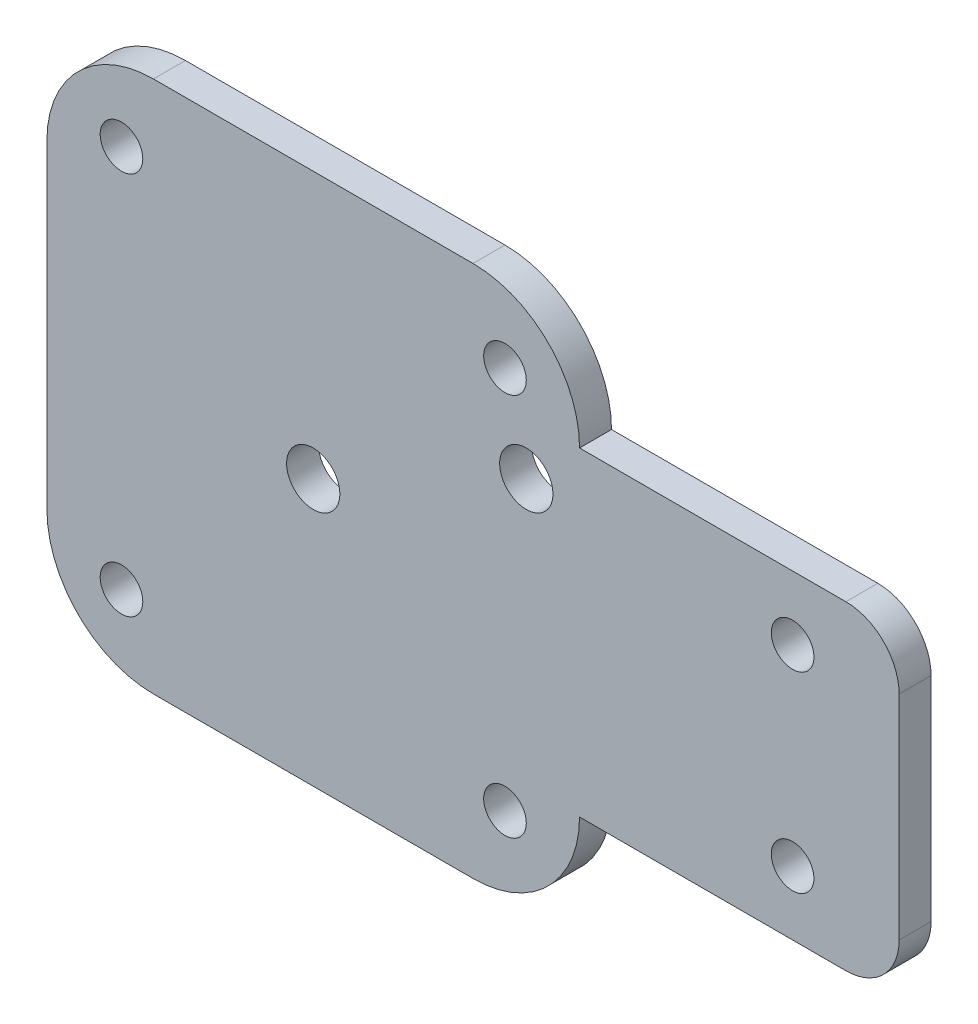
ISO-10303-21;
HEADER;
FILE_DESCRIPTION(('STEP AP214'),'2;1');
FILE_NAME('part.step','',(''),(''),'','','');
FILE_SCHEMA(('AUTOMOTIVE_DESIGN { 1 0 10303 214 1 1 1 1 }'));
ENDSEC;
DATA;
#1=APPLICATION_CONTEXT('core data for automotive mechanical design processes');
#2=APPLICATION_PROTOCOL_DEFINITION('international standard','automotive_design',2000,#1);
#3=PRODUCT_CONTEXT('',#1,'mechanical');
#4=PRODUCT('Part','Part','',(#3));
#5=PRODUCT_RELATED_PRODUCT_CATEGORY('part','',(#4));
#6=PRODUCT_DEFINITION_FORMATION('','',#4);
#7=PRODUCT_DEFINITION_CONTEXT('part definition',#1,'design');
#8=PRODUCT_DEFINITION('design','',#6,#7);
#9=PRODUCT_DEFINITION_SHAPE('','',#8);
#10=(LENGTH_UNIT() NAMED_UNIT(*) SI_UNIT(.MILLI.,.METRE.));
#11=(NAMED_UNIT(*) PLANE_ANGLE_UNIT() SI_UNIT($,.RADIAN.));
#12=(NAMED_UNIT(*) SI_UNIT($,.STERADIAN.) SOLID_ANGLE_UNIT());
#13=UNCERTAINTY_MEASURE_WITH_UNIT(LENGTH_MEASURE(1.E-05),#10,'distance_accuracy_value','');
#14=(GEOMETRIC_REPRESENTATION_CONTEXT(3) GLOBAL_UNCERTAINTY_ASSIGNED_CONTEXT((#13)) GLOBAL_UNIT_ASSIGNED_CONTEXT((#10,
#11,#12)) REPRESENTATION_CONTEXT('',''));
#15=CARTESIAN_POINT('',(0.,0.,0.));
#16=DIRECTION('',(0.,0.,1.));
#17=DIRECTION('',(1.,0.,0.));
#18=AXIS2_PLACEMENT_3D('',#15,#16,#17);
#19=CARTESIAN_POINT('',(10.,40.,3.));
#20=DIRECTION('',(0.,0.,-1.));
#21=DIRECTION('',(-1.,0.,0.));
#22=AXIS2_PLACEMENT_3D('',#19,#20,#21);
#23=CYLINDRICAL_SURFACE('',#22,10.);
#24=CARTESIAN_POINT('',(10.,40.,0.));
#25=DIRECTION('',(0.,0.,1.));
#26=DIRECTION('',(1.,0.,0.));
#27=AXIS2_PLACEMENT_3D('',#24,#25,#26);
#28=CIRCLE('',#27,10.);
#29=CARTESIAN_POINT('',(0.,39.9999999999999,0.));
#30=VERTEX_POINT('',#29);
#31=CARTESIAN_POINT('',(10.0000000000001,50.,0.));
#32=VERTEX_POINT('',#31);
#33=EDGE_CURVE('E180',#30,#32,#28,.F.);
#34=ORIENTED_EDGE('',*,*,#33,.F.);
#35=DIRECTION('',(0.,0.,-1.));
#36=VECTOR('',#35,1.);
#37=CARTESIAN_POINT('',(0.,39.9999999999999,3.));
#38=LINE('',#37,#36);
#39=CARTESIAN_POINT('',(0.,39.9999999999999,3.));
#40=VERTEX_POINT('',#39);
#41=EDGE_CURVE('E11',#40,#30,#38,.T.);
#42=ORIENTED_EDGE('',*,*,#41,.F.);
#43=CARTESIAN_POINT('',(10.,40.,3.));
#44=DIRECTION('',(0.,0.,1.));
#45=DIRECTION('',(1.,0.,0.));
#46=AXIS2_PLACEMENT_3D('',#43,#44,#45);
#47=CIRCLE('',#46,10.);
#48=CARTESIAN_POINT('',(10.0000000000001,50.,3.));
#49=VERTEX_POINT('',#48);
#50=EDGE_CURVE('E268',#40,#49,#47,.F.);
#51=ORIENTED_EDGE('',*,*,#50,.T.);
#52=DIRECTION('',(0.,0.,-1.));
#53=VECTOR('',#52,1.);
#54=CARTESIAN_POINT('',(10.0000000000001,50.,3.));
#55=LINE('',#54,#53);
#56=EDGE_CURVE('E54',#49,#32,#55,.T.);
#57=ORIENTED_EDGE('',*,*,#56,.T.);
#58=EDGE_LOOP('',(#34,#42,#51,#57));
#59=FACE_BOUND('',#58,.T.);
#60=ADVANCED_FACE('F37',(#59),#23,.T.);
#61=CARTESIAN_POINT('',(0.,0.,3.));
#62=DIRECTION('',(-1.,0.,0.));
#63=DIRECTION('',(0.,0.,1.));
#64=AXIS2_PLACEMENT_3D('',#61,#62,#63);
#65=PLANE('',#64);
#66=DIRECTION('',(0.,1.,0.));
#67=VECTOR('',#66,1.);
#68=CARTESIAN_POINT('',(0.,0.,0.));
#69=LINE('',#68,#67);
#70=CARTESIAN_POINT('',(0.,10.0000000000001,0.));
#71=VERTEX_POINT('',#70);
#72=EDGE_CURVE('E182',#71,#30,#69,.T.);
#73=ORIENTED_EDGE('',*,*,#72,.F.);
#74=DIRECTION('',(0.,0.,-1.));
#75=VECTOR('',#74,1.);
#76=CARTESIAN_POINT('',(0.,10.0000000000001,3.));
#77=LINE('',#76,#75);
#78=CARTESIAN_POINT('',(0.,10.0000000000001,3.));
#79=VERTEX_POINT('',#78);
#80=EDGE_CURVE('E46',#79,#71,#77,.T.);
#81=ORIENTED_EDGE('',*,*,#80,.F.);
#82=DIRECTION('',(0.,1.,0.));
#83=VECTOR('',#82,1.);
#84=CARTESIAN_POINT('',(0.,0.,3.));
#85=LINE('',#84,#83);
#86=EDGE_CURVE('E266',#79,#40,#85,.T.);
#87=ORIENTED_EDGE('',*,*,#86,.T.);
#88=ORIENTED_EDGE('',*,*,#41,.T.);
#89=EDGE_LOOP('',(#73,#81,#87,#88));
#90=FACE_BOUND('',#89,.T.);
#91=ADVANCED_FACE('F252',(#90),#65,.T.);
#92=CARTESIAN_POINT('',(10.,10.,3.));
#93=DIRECTION('',(0.,0.,-1.));
#94=DIRECTION('',(-1.,0.,0.));
#95=AXIS2_PLACEMENT_3D('',#92,#93,#94);
#96=CYLINDRICAL_SURFACE('',#95,10.);
#97=CARTESIAN_POINT('',(10.,10.,0.));
#98=DIRECTION('',(0.,0.,1.));
#99=DIRECTION('',(1.,0.,0.));
#100=AXIS2_PLACEMENT_3D('',#97,#98,#99);
#101=CIRCLE('',#100,10.);
#102=CARTESIAN_POINT('',(10.0000000000001,0.,0.));
#103=VERTEX_POINT('',#102);
#104=EDGE_CURVE('E185',#103,#71,#101,.F.);
#105=ORIENTED_EDGE('',*,*,#104,.F.);
#106=DIRECTION('',(0.,0.,-1.));
#107=VECTOR('',#106,1.);
#108=CARTESIAN_POINT('',(10.0000000000001,0.,3.));
#109=LINE('',#108,#107);
#110=CARTESIAN_POINT('',(10.0000000000001,0.,3.));
#111=VERTEX_POINT('',#110);
#112=EDGE_CURVE('E241',#111,#103,#109,.T.);
#113=ORIENTED_EDGE('',*,*,#112,.F.);
#114=CARTESIAN_POINT('',(10.,10.,3.));
#115=DIRECTION('',(0.,0.,1.));
#116=DIRECTION('',(1.,0.,0.));
#117=AXIS2_PLACEMENT_3D('',#114,#115,#116);
#118=CIRCLE('',#117,10.);
#119=EDGE_CURVE('E248',#111,#79,#118,.F.);
#120=ORIENTED_EDGE('',*,*,#119,.T.);
#121=ORIENTED_EDGE('',*,*,#80,.T.);
#122=EDGE_LOOP('',(#105,#113,#120,#121));
#123=FACE_BOUND('',#122,.T.);
#124=ADVANCED_FACE('F246',(#123),#96,.T.);
#125=CARTESIAN_POINT('',(0.,0.,3.));
#126=DIRECTION('',(0.,1.,0.));
#127=DIRECTION('',(0.,0.,1.));
#128=AXIS2_PLACEMENT_3D('',#125,#126,#127);
#129=PLANE('',#128);
#130=DIRECTION('',(1.,0.,0.));
#131=VECTOR('',#130,1.);
#132=CARTESIAN_POINT('',(0.,0.,0.));
#133=LINE('',#132,#131);
#134=CARTESIAN_POINT('',(39.9999999999999,0.,0.));
#135=VERTEX_POINT('',#134);
#136=EDGE_CURVE('E188',#103,#135,#133,.T.);
#137=ORIENTED_EDGE('',*,*,#136,.T.);
#138=DIRECTION('',(0.,0.,-1.));
#139=VECTOR('',#138,1.);
#140=CARTESIAN_POINT('',(39.9999999999999,0.,3.));
#141=LINE('',#140,#139);
#142=CARTESIAN_POINT('',(39.9999999999999,0.,3.));
#143=VERTEX_POINT('',#142);
#144=EDGE_CURVE('E238',#143,#135,#141,.T.);
#145=ORIENTED_EDGE('',*,*,#144,.F.);
#146=DIRECTION('',(1.,0.,0.));
#147=VECTOR('',#146,1.);
#148=CARTESIAN_POINT('',(0.,0.,3.));
#149=LINE('',#148,#147);
#150=EDGE_CURVE('E262',#111,#143,#149,.T.);
#151=ORIENTED_EDGE('',*,*,#150,.F.);
#152=ORIENTED_EDGE('',*,*,#112,.T.);
#153=EDGE_LOOP('',(#137,#145,#151,#152));
#154=FACE_BOUND('',#153,.T.);
#155=ADVANCED_FACE('F259',(#154),#129,.F.);
#156=CARTESIAN_POINT('',(40.,10.,3.));
#157=DIRECTION('',(0.,0.,-1.));
#158=DIRECTION('',(-1.,0.,0.));
#159=AXIS2_PLACEMENT_3D('',#156,#157,#158);
#160=CYLINDRICAL_SURFACE('',#159,10.);
#161=CARTESIAN_POINT('',(40.,10.,0.));
#162=DIRECTION('',(0.,0.,1.));
#163=DIRECTION('',(1.,0.,0.));
#164=AXIS2_PLACEMENT_3D('',#161,#162,#163);
#165=CIRCLE('',#164,10.);
#166=CARTESIAN_POINT('',(50.,10.0000000000001,0.));
#167=VERTEX_POINT('',#166);
#168=EDGE_CURVE('E191',#135,#167,#165,.T.);
#169=ORIENTED_EDGE('',*,*,#168,.T.);
#170=DIRECTION('',(0.,0.,-1.));
#171=VECTOR('',#170,1.);
#172=CARTESIAN_POINT('',(50.,10.0000000000001,3.));
#173=LINE('',#172,#171);
#174=CARTESIAN_POINT('',(50.,10.0000000000001,3.));
#175=VERTEX_POINT('',#174);
#176=EDGE_CURVE('E235',#175,#167,#173,.T.);
#177=ORIENTED_EDGE('',*,*,#176,.F.);
#178=CARTESIAN_POINT('',(40.,10.,3.));
#179=DIRECTION('',(0.,0.,1.));
#180=DIRECTION('',(1.,0.,0.));
#181=AXIS2_PLACEMENT_3D('',#178,#179,#180);
#182=CIRCLE('',#181,10.);
#183=EDGE_CURVE('E264',#143,#175,#182,.T.);
#184=ORIENTED_EDGE('',*,*,#183,.F.);
#185=ORIENTED_EDGE('',*,*,#144,.T.);
#186=EDGE_LOOP('',(#169,#177,#184,#185));
#187=FACE_BOUND('',#186,.T.);
#188=ADVANCED_FACE('F474',(#187),#160,.T.);
#189=CARTESIAN_POINT('',(0.,10.0000000000002,3.));
#190=DIRECTION('',(0.,1.,0.));
#191=DIRECTION('',(-1.,0.,0.));
#192=AXIS2_PLACEMENT_3D('',#189,#190,#191);
#193=PLANE('',#192);
#194=DIRECTION('',(1.,0.,0.));
#195=VECTOR('',#194,1.);
#196=CARTESIAN_POINT('',(0.,10.0000000000002,0.));
#197=LINE('',#196,#195);
#198=CARTESIAN_POINT('',(75.,10.,0.));
#199=VERTEX_POINT('',#198);
#200=EDGE_CURVE('E194',#167,#199,#197,.T.);
#201=ORIENTED_EDGE('',*,*,#200,.T.);
#202=DIRECTION('',(0.,0.,-1.));
#203=VECTOR('',#202,1.);
#204=CARTESIAN_POINT('',(75.,10.,3.));
#205=LINE('',#204,#203);
#206=CARTESIAN_POINT('',(75.,10.,3.));
#207=VERTEX_POINT('',#206);
#208=EDGE_CURVE('E232',#207,#199,#205,.T.);
#209=ORIENTED_EDGE('',*,*,#208,.F.);
#210=DIRECTION('',(1.,0.,0.));
#211=VECTOR('',#210,1.);
#212=CARTESIAN_POINT('',(0.,10.0000000000002,3.));
#213=LINE('',#212,#211);
#214=EDGE_CURVE('E273',#175,#207,#213,.T.);
#215=ORIENTED_EDGE('',*,*,#214,.F.);
#216=ORIENTED_EDGE('',*,*,#176,.T.);
#217=EDGE_LOOP('',(#201,#209,#215,#216));
#218=FACE_BOUND('',#217,.T.);
#219=ADVANCED_FACE('F465',(#218),#193,.F.);
#220=CARTESIAN_POINT('',(75.,15.,3.));
#221=DIRECTION('',(0.,0.,-1.));
#222=DIRECTION('',(-1.,0.,0.));
#223=AXIS2_PLACEMENT_3D('',#220,#221,#222);
#224=CYLINDRICAL_SURFACE('',#223,5.);
#225=CARTESIAN_POINT('',(75.,15.,0.));
#226=DIRECTION('',(0.,0.,1.));
#227=DIRECTION('',(1.,0.,0.));
#228=AXIS2_PLACEMENT_3D('',#225,#226,#227);
#229=CIRCLE('',#228,5.);
#230=CARTESIAN_POINT('',(80.,15.,0.));
#231=VERTEX_POINT('',#230);
#232=EDGE_CURVE('E197',#199,#231,#229,.T.);
#233=ORIENTED_EDGE('',*,*,#232,.T.);
#234=DIRECTION('',(0.,0.,-1.));
#235=VECTOR('',#234,1.);
#236=CARTESIAN_POINT('',(80.,15.,3.));
#237=LINE('',#236,#235);
#238=CARTESIAN_POINT('',(80.,15.,3.));
#239=VERTEX_POINT('',#238);
#240=EDGE_CURVE('E230',#239,#231,#237,.T.);
#241=ORIENTED_EDGE('',*,*,#240,.F.);
#242=CARTESIAN_POINT('',(75.,15.,3.));
#243=DIRECTION('',(0.,0.,1.));
#244=DIRECTION('',(1.,0.,0.));
#245=AXIS2_PLACEMENT_3D('',#242,#243,#244);
#246=CIRCLE('',#245,5.);
#247=EDGE_CURVE('E276',#207,#239,#246,.T.);
#248=ORIENTED_EDGE('',*,*,#247,.F.);
#249=ORIENTED_EDGE('',*,*,#208,.T.);
#250=EDGE_LOOP('',(#233,#241,#248,#249));
#251=FACE_BOUND('',#250,.T.);
#252=ADVANCED_FACE('F456',(#251),#224,.T.);
#253=CARTESIAN_POINT('',(80.,0.,3.));
#254=DIRECTION('',(1.,0.,0.));
#255=DIRECTION('',(0.,0.,-1.));
#256=AXIS2_PLACEMENT_3D('',#253,#254,#255);
#257=PLANE('',#256);
#258=DIRECTION('',(0.,-1.,0.));
#259=VECTOR('',#258,1.);
#260=CARTESIAN_POINT('',(80.,0.,0.));
#261=LINE('',#260,#259);
#262=CARTESIAN_POINT('',(80.,35.,0.));
#263=VERTEX_POINT('',#262);
#264=EDGE_CURVE('E200',#263,#231,#261,.T.);
#265=ORIENTED_EDGE('',*,*,#264,.F.);
#266=DIRECTION('',(0.,0.,-1.));
#267=VECTOR('',#266,1.);
#268=CARTESIAN_POINT('',(80.,35.,3.));
#269=LINE('',#268,#267);
#270=CARTESIAN_POINT('',(80.,35.,3.));
#271=VERTEX_POINT('',#270);
#272=EDGE_CURVE('E228',#271,#263,#269,.T.);
#273=ORIENTED_EDGE('',*,*,#272,.F.);
#274=DIRECTION('',(0.,-1.,0.));
#275=VECTOR('',#274,1.);
#276=CARTESIAN_POINT('',(80.,0.,3.));
#277=LINE('',#276,#275);
#278=EDGE_CURVE('E278',#271,#239,#277,.T.);
#279=ORIENTED_EDGE('',*,*,#278,.T.);
#280=ORIENTED_EDGE('',*,*,#240,.T.);
#281=EDGE_LOOP('',(#265,#273,#279,#280));
#282=FACE_BOUND('',#281,.T.);
#283=ADVANCED_FACE('F448',(#282),#257,.T.);
#284=CARTESIAN_POINT('',(75.,35.,3.));
#285=DIRECTION('',(0.,0.,-1.));
#286=DIRECTION('',(-1.,0.,0.));
#287=AXIS2_PLACEMENT_3D('',#284,#285,#286);
#288=CYLINDRICAL_SURFACE('',#287,5.);
#289=CARTESIAN_POINT('',(75.,35.,0.));
#290=DIRECTION('',(0.,0.,1.));
#291=DIRECTION('',(1.,0.,0.));
#292=AXIS2_PLACEMENT_3D('',#289,#290,#291);
#293=CIRCLE('',#292,5.);
#294=CARTESIAN_POINT('',(75.,40.,0.));
#295=VERTEX_POINT('',#294);
#296=EDGE_CURVE('E203',#295,#263,#293,.F.);
#297=ORIENTED_EDGE('',*,*,#296,.F.);
#298=DIRECTION('',(0.,0.,-1.));
#299=VECTOR('',#298,1.);
#300=CARTESIAN_POINT('',(75.,40.,3.));
#301=LINE('',#300,#299);
#302=CARTESIAN_POINT('',(75.,40.,3.));
#303=VERTEX_POINT('',#302);
#304=EDGE_CURVE('E137',#303,#295,#301,.T.);
#305=ORIENTED_EDGE('',*,*,#304,.F.);
#306=CARTESIAN_POINT('',(75.,35.,3.));
#307=DIRECTION('',(0.,0.,1.));
#308=DIRECTION('',(1.,0.,0.));
#309=AXIS2_PLACEMENT_3D('',#306,#307,#308);
#310=CIRCLE('',#309,5.);
#311=EDGE_CURVE('E148',#303,#271,#310,.F.);
#312=ORIENTED_EDGE('',*,*,#311,.T.);
#313=ORIENTED_EDGE('',*,*,#272,.T.);
#314=EDGE_LOOP('',(#297,#305,#312,#313));
#315=FACE_BOUND('',#314,.T.);
#316=ADVANCED_FACE('F282',(#315),#288,.T.);
#317=CARTESIAN_POINT('',(-1.11022302462515E-13,39.9999999999998,3.));
#318=DIRECTION('',(0.,1.,0.));
#319=DIRECTION('',(-1.,0.,0.));
#320=AXIS2_PLACEMENT_3D('',#317,#318,#319);
#321=PLANE('',#320);
#322=DIRECTION('',(1.,0.,0.));
#323=VECTOR('',#322,1.);
#324=CARTESIAN_POINT('',(-1.11022302462515E-13,39.9999999999998,0.));
#325=LINE('',#324,#323);
#326=CARTESIAN_POINT('',(50.,39.9999999999999,0.));
#327=VERTEX_POINT('',#326);
#328=EDGE_CURVE('E133',#327,#295,#325,.T.);
#329=ORIENTED_EDGE('',*,*,#328,.F.);
#330=DIRECTION('',(0.,0.,-1.));
#331=VECTOR('',#330,1.);
#332=CARTESIAN_POINT('',(50.,39.9999999999999,3.));
#333=LINE('',#332,#331);
#334=CARTESIAN_POINT('',(50.,39.9999999999999,3.));
#335=VERTEX_POINT('',#334);
#336=EDGE_CURVE('E128',#335,#327,#333,.T.);
#337=ORIENTED_EDGE('',*,*,#336,.F.);
#338=DIRECTION('',(1.,0.,0.));
#339=VECTOR('',#338,1.);
#340=CARTESIAN_POINT('',(-1.11022302462515E-13,39.9999999999998,3.));
#341=LINE('',#340,#339);
#342=EDGE_CURVE('E131',#335,#303,#341,.T.);
#343=ORIENTED_EDGE('',*,*,#342,.T.);
#344=ORIENTED_EDGE('',*,*,#304,.T.);
#345=EDGE_LOOP('',(#329,#337,#343,#344));
#346=FACE_BOUND('',#345,.T.);
#347=ADVANCED_FACE('F130',(#346),#321,.T.);
#348=CARTESIAN_POINT('',(40.,40.,3.));
#349=DIRECTION('',(0.,0.,-1.));
#350=DIRECTION('',(-1.,0.,0.));
#351=AXIS2_PLACEMENT_3D('',#348,#349,#350);
#352=CYLINDRICAL_SURFACE('',#351,10.);
#353=CARTESIAN_POINT('',(40.,40.,0.));
#354=DIRECTION('',(0.,0.,1.));
#355=DIRECTION('',(1.,0.,0.));
#356=AXIS2_PLACEMENT_3D('',#353,#354,#355);
#357=CIRCLE('',#356,10.);
#358=CARTESIAN_POINT('',(39.9999999999999,50.,0.));
#359=VERTEX_POINT('',#358);
#360=EDGE_CURVE('E207',#359,#327,#357,.F.);
#361=ORIENTED_EDGE('',*,*,#360,.F.);
#362=DIRECTION('',(0.,0.,-1.));
#363=VECTOR('',#362,1.);
#364=CARTESIAN_POINT('',(39.9999999999999,50.,3.));
#365=LINE('',#364,#363);
#366=CARTESIAN_POINT('',(39.9999999999999,50.,3.));
#367=VERTEX_POINT('',#366);
#368=EDGE_CURVE('E91',#367,#359,#365,.T.);
#369=ORIENTED_EDGE('',*,*,#368,.F.);
#370=CARTESIAN_POINT('',(40.,40.,3.));
#371=DIRECTION('',(0.,0.,1.));
#372=DIRECTION('',(1.,0.,0.));
#373=AXIS2_PLACEMENT_3D('',#370,#371,#372);
#374=CIRCLE('',#373,10.);
#375=EDGE_CURVE('E145',#367,#335,#374,.F.);
#376=ORIENTED_EDGE('',*,*,#375,.T.);
#377=ORIENTED_EDGE('',*,*,#336,.T.);
#378=EDGE_LOOP('',(#361,#369,#376,#377));
#379=FACE_BOUND('',#378,.T.);
#380=ADVANCED_FACE('F150',(#379),#352,.T.);
#381=CARTESIAN_POINT('',(70.,16.,3.));
#382=DIRECTION('',(0.,0.,-1.));
#383=DIRECTION('',(-1.,0.,0.));
#384=AXIS2_PLACEMENT_3D('',#381,#382,#383);
#385=CYLINDRICAL_SURFACE('',#384,2.);
#386=CARTESIAN_POINT('',(70.,16.,3.));
#387=DIRECTION('',(0.,0.,1.));
#388=DIRECTION('',(1.,0.,0.));
#389=AXIS2_PLACEMENT_3D('',#386,#387,#388);
#390=CIRCLE('',#389,2.);
#391=CARTESIAN_POINT('',(72.,16.,3.));
#392=VERTEX_POINT('',#391);
#393=EDGE_CURVE('E162',#392,#392,#390,.T.);
#394=ORIENTED_EDGE('',*,*,#393,.T.);
#395=EDGE_LOOP('',(#394));
#396=FACE_BOUND('',#395,.T.);
#397=CARTESIAN_POINT('',(70.,16.,0.));
#398=DIRECTION('',(0.,0.,1.));
#399=DIRECTION('',(1.,0.,0.));
#400=AXIS2_PLACEMENT_3D('',#397,#398,#399);
#401=CIRCLE('',#400,2.);
#402=CARTESIAN_POINT('',(72.,16.,0.));
#403=VERTEX_POINT('',#402);
#404=EDGE_CURVE('E218',#403,#403,#401,.T.);
#405=ORIENTED_EDGE('',*,*,#404,.F.);
#406=EDGE_LOOP('',(#405));
#407=FACE_BOUND('',#406,.T.);
#408=ADVANCED_FACE('F342',(#396,#407),#385,.F.);
#409=CARTESIAN_POINT('',(7.,7.,3.));
#410=DIRECTION('',(0.,0.,-1.));
#411=DIRECTION('',(-1.,0.,0.));
#412=AXIS2_PLACEMENT_3D('',#409,#410,#411);
#413=CYLINDRICAL_SURFACE('',#412,2.);
#414=CARTESIAN_POINT('',(7.,7.,3.));
#415=DIRECTION('',(0.,0.,1.));
#416=DIRECTION('',(1.,0.,0.));
#417=AXIS2_PLACEMENT_3D('',#414,#415,#416);
#418=CIRCLE('',#417,2.);
#419=CARTESIAN_POINT('',(9.,7.,3.));
#420=VERTEX_POINT('',#419);
#421=EDGE_CURVE('E159',#420,#420,#418,.F.);
#422=ORIENTED_EDGE('',*,*,#421,.F.);
#423=EDGE_LOOP('',(#422));
#424=FACE_BOUND('',#423,.T.);
#425=CARTESIAN_POINT('',(7.,7.,0.));
#426=DIRECTION('',(0.,0.,1.));
#427=DIRECTION('',(1.,0.,0.));
#428=AXIS2_PLACEMENT_3D('',#425,#426,#427);
#429=CIRCLE('',#428,2.);
#430=CARTESIAN_POINT('',(9.,7.,0.));
#431=VERTEX_POINT('',#430);
#432=EDGE_CURVE('E215',#431,#431,#429,.F.);
#433=ORIENTED_EDGE('',*,*,#432,.T.);
#434=EDGE_LOOP('',(#433));
#435=FACE_BOUND('',#434,.T.);
#436=ADVANCED_FACE('F296',(#424,#435),#413,.F.);
#437=CARTESIAN_POINT('',(43.,7.,3.));
#438=DIRECTION('',(0.,0.,-1.));
#439=DIRECTION('',(-1.,0.,0.));
#440=AXIS2_PLACEMENT_3D('',#437,#438,#439);
#441=CYLINDRICAL_SURFACE('',#440,2.);
#442=CARTESIAN_POINT('',(43.,7.,3.));
#443=DIRECTION('',(0.,0.,1.));
#444=DIRECTION('',(1.,0.,0.));
#445=AXIS2_PLACEMENT_3D('',#442,#443,#444);
#446=CIRCLE('',#445,2.);
#447=CARTESIAN_POINT('',(45.,7.,3.));
#448=VERTEX_POINT('',#447);
#449=EDGE_CURVE('E153',#448,#448,#446,.T.);
#450=ORIENTED_EDGE('',*,*,#449,.T.);
#451=EDGE_LOOP('',(#450));
#452=FACE_BOUND('',#451,.T.);
#453=CARTESIAN_POINT('',(43.,7.,0.));
#454=DIRECTION('',(0.,0.,1.));
#455=DIRECTION('',(1.,0.,0.));
#456=AXIS2_PLACEMENT_3D('',#453,#454,#455);
#457=CIRCLE('',#456,2.);
#458=CARTESIAN_POINT('',(45.,7.,0.));
#459=VERTEX_POINT('',#458);
#460=EDGE_CURVE('E212',#459,#459,#457,.T.);
#461=ORIENTED_EDGE('',*,*,#460,.F.);
#462=EDGE_LOOP('',(#461));
#463=FACE_BOUND('',#462,.T.);
#464=ADVANCED_FACE('F287',(#452,#463),#441,.F.);
#465=CARTESIAN_POINT('',(0.,50.,3.));
#466=DIRECTION('',(0.,1.,0.));
#467=DIRECTION('',(0.,0.,1.));
#468=AXIS2_PLACEMENT_3D('',#465,#466,#467);
#469=PLANE('',#468);
#470=DIRECTION('',(1.,0.,0.));
#471=VECTOR('',#470,1.);
#472=CARTESIAN_POINT('',(0.,50.,0.));
#473=LINE('',#472,#471);
#474=EDGE_CURVE('E209',#32,#359,#473,.T.);
#475=ORIENTED_EDGE('',*,*,#474,.F.);
#476=ORIENTED_EDGE('',*,*,#56,.F.);
#477=DIRECTION('',(1.,0.,0.));
#478=VECTOR('',#477,1.);
#479=CARTESIAN_POINT('',(0.,50.,3.));
#480=LINE('',#479,#478);
#481=EDGE_CURVE('E151',#49,#367,#480,.T.);
#482=ORIENTED_EDGE('',*,*,#481,.T.);
#483=ORIENTED_EDGE('',*,*,#368,.T.);
#484=EDGE_LOOP('',(#475,#476,#482,#483));
#485=FACE_BOUND('',#484,.T.);
#486=ADVANCED_FACE('F284',(#485),#469,.T.);
#487=CARTESIAN_POINT('',(7.,43.,3.));
#488=DIRECTION('',(0.,0.,-1.));
#489=DIRECTION('',(-1.,0.,0.));
#490=AXIS2_PLACEMENT_3D('',#487,#488,#489);
#491=CYLINDRICAL_SURFACE('',#490,2.);
#492=CARTESIAN_POINT('',(7.,43.,3.));
#493=DIRECTION('',(0.,0.,1.));
#494=DIRECTION('',(1.,0.,0.));
#495=AXIS2_PLACEMENT_3D('',#492,#493,#494);
#496=CIRCLE('',#495,2.);
#497=CARTESIAN_POINT('',(9.,43.,3.));
#498=VERTEX_POINT('',#497);
#499=EDGE_CURVE('E532',#498,#498,#496,.T.);
#500=ORIENTED_EDGE('',*,*,#499,.T.);
#501=EDGE_LOOP('',(#500));
#502=FACE_BOUND('',#501,.T.);
#503=CARTESIAN_POINT('',(7.,43.,0.));
#504=DIRECTION('',(0.,0.,1.));
#505=DIRECTION('',(1.,0.,0.));
#506=AXIS2_PLACEMENT_3D('',#503,#504,#505);
#507=CIRCLE('',#506,2.);
#508=CARTESIAN_POINT('',(9.,43.,0.));
#509=VERTEX_POINT('',#508);
#510=EDGE_CURVE('E177',#509,#509,#507,.T.);
#511=ORIENTED_EDGE('',*,*,#510,.F.);
#512=EDGE_LOOP('',(#511));
#513=FACE_BOUND('',#512,.T.);
#514=ADVANCED_FACE('F286',(#502,#513),#491,.F.);
#515=CARTESIAN_POINT('',(43.,43.,3.));
#516=DIRECTION('',(0.,0.,-1.));
#517=DIRECTION('',(-1.,0.,0.));
#518=AXIS2_PLACEMENT_3D('',#515,#516,#517);
#519=CYLINDRICAL_SURFACE('',#518,2.);
#520=CARTESIAN_POINT('',(43.,43.,3.));
#521=DIRECTION('',(0.,0.,1.));
#522=DIRECTION('',(1.,0.,0.));
#523=AXIS2_PLACEMENT_3D('',#520,#521,#522);
#524=CIRCLE('',#523,2.);
#525=CARTESIAN_POINT('',(45.,43.,3.));
#526=VERTEX_POINT('',#525);
#527=EDGE_CURVE('E529',#526,#526,#524,.F.);
#528=ORIENTED_EDGE('',*,*,#527,.F.);
#529=EDGE_LOOP('',(#528));
#530=FACE_BOUND('',#529,.T.);
#531=CARTESIAN_POINT('',(43.,43.,0.));
#532=DIRECTION('',(0.,0.,1.));
#533=DIRECTION('',(1.,0.,0.));
#534=AXIS2_PLACEMENT_3D('',#531,#532,#533);
#535=CIRCLE('',#534,2.);
#536=CARTESIAN_POINT('',(45.,43.,0.));
#537=VERTEX_POINT('',#536);
#538=EDGE_CURVE('E174',#537,#537,#535,.F.);
#539=ORIENTED_EDGE('',*,*,#538,.T.);
#540=EDGE_LOOP('',(#539));
#541=FACE_BOUND('',#540,.T.);
#542=ADVANCED_FACE('F293',(#530,#541),#519,.F.);
#543=CARTESIAN_POINT('',(25.,25.,3.));
#544=DIRECTION('',(0.,0.,-1.));
#545=DIRECTION('',(-1.,0.,0.));
#546=AXIS2_PLACEMENT_3D('',#543,#544,#545);
#547=CYLINDRICAL_SURFACE('',#546,2.5);
#548=CARTESIAN_POINT('',(25.,25.,3.));
#549=DIRECTION('',(0.,0.,1.));
#550=DIRECTION('',(1.,0.,0.));
#551=AXIS2_PLACEMENT_3D('',#548,#549,#550);
#552=CIRCLE('',#551,2.5);
#553=CARTESIAN_POINT('',(27.5,25.,3.));
#554=VERTEX_POINT('',#553);
#555=EDGE_CURVE('E321',#554,#554,#552,.T.);
#556=ORIENTED_EDGE('',*,*,#555,.T.);
#557=EDGE_LOOP('',(#556));
#558=FACE_BOUND('',#557,.T.);
#559=CARTESIAN_POINT('',(25.,25.,0.));
#560=DIRECTION('',(0.,0.,1.));
#561=DIRECTION('',(1.,0.,0.));
#562=AXIS2_PLACEMENT_3D('',#559,#560,#561);
#563=CIRCLE('',#562,2.5);
#564=CARTESIAN_POINT('',(27.5,25.,0.));
#565=VERTEX_POINT('',#564);
#566=EDGE_CURVE('E171',#565,#565,#563,.T.);
#567=ORIENTED_EDGE('',*,*,#566,.F.);
#568=EDGE_LOOP('',(#567));
#569=FACE_BOUND('',#568,.T.);
#570=ADVANCED_FACE('F309',(#558,#569),#547,.F.);
#571=CARTESIAN_POINT('',(45.,35.,3.));
#572=DIRECTION('',(0.,0.,-1.));
#573=DIRECTION('',(-1.,0.,0.));
#574=AXIS2_PLACEMENT_3D('',#571,#572,#573);
#575=CYLINDRICAL_SURFACE('',#574,2.5);
#576=CARTESIAN_POINT('',(45.,35.,3.));
#577=DIRECTION('',(0.,0.,1.));
#578=DIRECTION('',(1.,0.,0.));
#579=AXIS2_PLACEMENT_3D('',#576,#577,#578);
#580=CIRCLE('',#579,2.5);
#581=CARTESIAN_POINT('',(47.5,35.,3.));
#582=VERTEX_POINT('',#581);
#583=EDGE_CURVE('E224',#582,#582,#580,.T.);
#584=ORIENTED_EDGE('',*,*,#583,.T.);
#585=EDGE_LOOP('',(#584));
#586=FACE_BOUND('',#585,.T.);
#587=CARTESIAN_POINT('',(45.,35.,0.));
#588=DIRECTION('',(0.,0.,1.));
#589=DIRECTION('',(1.,0.,0.));
#590=AXIS2_PLACEMENT_3D('',#587,#588,#589);
#591=CIRCLE('',#590,2.5);
#592=CARTESIAN_POINT('',(47.5,35.,0.));
#593=VERTEX_POINT('',#592);
#594=EDGE_CURVE('E168',#593,#593,#591,.T.);
#595=ORIENTED_EDGE('',*,*,#594,.F.);
#596=EDGE_LOOP('',(#595));
#597=FACE_BOUND('',#596,.T.);
#598=ADVANCED_FACE('F39',(#586,#597),#575,.F.);
#599=CARTESIAN_POINT('',(70.,34.,3.));
#600=DIRECTION('',(0.,0.,-1.));
#601=DIRECTION('',(-1.,0.,0.));
#602=AXIS2_PLACEMENT_3D('',#599,#600,#601);
#603=CYLINDRICAL_SURFACE('',#602,2.);
#604=CARTESIAN_POINT('',(70.,34.,3.));
#605=DIRECTION('',(0.,0.,1.));
#606=DIRECTION('',(1.,0.,0.));
#607=AXIS2_PLACEMENT_3D('',#604,#605,#606);
#608=CIRCLE('',#607,2.);
#609=CARTESIAN_POINT('',(72.,34.,3.));
#610=VERTEX_POINT('',#609);
#611=EDGE_CURVE('E165',#610,#610,#608,.T.);
#612=ORIENTED_EDGE('',*,*,#611,.T.);
#613=EDGE_LOOP('',(#612));
#614=FACE_BOUND('',#613,.T.);
#615=CARTESIAN_POINT('',(70.,34.,0.));
#616=DIRECTION('',(0.,0.,1.));
#617=DIRECTION('',(1.,0.,0.));
#618=AXIS2_PLACEMENT_3D('',#615,#616,#617);
#619=CIRCLE('',#618,2.);
#620=CARTESIAN_POINT('',(72.,34.,0.));
#621=VERTEX_POINT('',#620);
#622=EDGE_CURVE('E221',#621,#621,#619,.T.);
#623=ORIENTED_EDGE('',*,*,#622,.F.);
#624=EDGE_LOOP('',(#623));
#625=FACE_BOUND('',#624,.T.);
#626=ADVANCED_FACE('F316',(#614,#625),#603,.F.);
#627=CARTESIAN_POINT('',(0.,0.,3.));
#628=DIRECTION('',(0.,0.,1.));
#629=DIRECTION('',(1.,0.,0.));
#630=AXIS2_PLACEMENT_3D('',#627,#628,#629);
#631=PLANE('',#630);
#632=ORIENTED_EDGE('',*,*,#583,.F.);
#633=EDGE_LOOP('',(#632));
#634=FACE_BOUND('',#633,.T.);
#635=ORIENTED_EDGE('',*,*,#555,.F.);
#636=EDGE_LOOP('',(#635));
#637=FACE_BOUND('',#636,.T.);
#638=ORIENTED_EDGE('',*,*,#527,.T.);
#639=EDGE_LOOP('',(#638));
#640=FACE_BOUND('',#639,.T.);
#641=ORIENTED_EDGE('',*,*,#499,.F.);
#642=EDGE_LOOP('',(#641));
#643=FACE_BOUND('',#642,.T.);
#644=ORIENTED_EDGE('',*,*,#50,.F.);
#645=ORIENTED_EDGE('',*,*,#86,.F.);
#646=ORIENTED_EDGE('',*,*,#119,.F.);
#647=ORIENTED_EDGE('',*,*,#150,.T.);
#648=ORIENTED_EDGE('',*,*,#183,.T.);
#649=ORIENTED_EDGE('',*,*,#214,.T.);
#650=ORIENTED_EDGE('',*,*,#247,.T.);
#651=ORIENTED_EDGE('',*,*,#278,.F.);
#652=ORIENTED_EDGE('',*,*,#311,.F.);
#653=ORIENTED_EDGE('',*,*,#342,.F.);
#654=ORIENTED_EDGE('',*,*,#375,.F.);
#655=ORIENTED_EDGE('',*,*,#481,.F.);
#656=EDGE_LOOP('',(#644,#645,#646,#647,#648,#649,#650,#651,#652,#653,#654,#655));
#657=FACE_BOUND('',#656,.T.);
#658=ORIENTED_EDGE('',*,*,#449,.F.);
#659=EDGE_LOOP('',(#658));
#660=FACE_BOUND('',#659,.T.);
#661=ORIENTED_EDGE('',*,*,#421,.T.);
#662=EDGE_LOOP('',(#661));
#663=FACE_BOUND('',#662,.T.);
#664=ORIENTED_EDGE('',*,*,#393,.F.);
#665=EDGE_LOOP('',(#664));
#666=FACE_BOUND('',#665,.T.);
#667=ORIENTED_EDGE('',*,*,#611,.F.);
#668=EDGE_LOOP('',(#667));
#669=FACE_BOUND('',#668,.T.);
#670=ADVANCED_FACE('F142',(#634,#637,#640,#643,#657,#660,#663,#666,#669),#631,.T.);
#671=CARTESIAN_POINT('',(0.,0.,0.));
#672=DIRECTION('',(0.,0.,1.));
#673=DIRECTION('',(1.,0.,0.));
#674=AXIS2_PLACEMENT_3D('',#671,#672,#673);
#675=PLANE('',#674);
#676=ORIENTED_EDGE('',*,*,#594,.T.);
#677=EDGE_LOOP('',(#676));
#678=FACE_BOUND('',#677,.T.);
#679=ORIENTED_EDGE('',*,*,#566,.T.);
#680=EDGE_LOOP('',(#679));
#681=FACE_BOUND('',#680,.T.);
#682=ORIENTED_EDGE('',*,*,#538,.F.);
#683=EDGE_LOOP('',(#682));
#684=FACE_BOUND('',#683,.T.);
#685=ORIENTED_EDGE('',*,*,#510,.T.);
#686=EDGE_LOOP('',(#685));
#687=FACE_BOUND('',#686,.T.);
#688=ORIENTED_EDGE('',*,*,#33,.T.);
#689=ORIENTED_EDGE('',*,*,#474,.T.);
#690=ORIENTED_EDGE('',*,*,#360,.T.);
#691=ORIENTED_EDGE('',*,*,#328,.T.);
#692=ORIENTED_EDGE('',*,*,#296,.T.);
#693=ORIENTED_EDGE('',*,*,#264,.T.);
#694=ORIENTED_EDGE('',*,*,#232,.F.);
#695=ORIENTED_EDGE('',*,*,#200,.F.);
#696=ORIENTED_EDGE('',*,*,#168,.F.);
#697=ORIENTED_EDGE('',*,*,#136,.F.);
#698=ORIENTED_EDGE('',*,*,#104,.T.);
#699=ORIENTED_EDGE('',*,*,#72,.T.);
#700=EDGE_LOOP('',(#688,#689,#690,#691,#692,#693,#694,#695,#696,#697,#698,#699));
#701=FACE_BOUND('',#700,.T.);
#702=ORIENTED_EDGE('',*,*,#460,.T.);
#703=EDGE_LOOP('',(#702));
#704=FACE_BOUND('',#703,.T.);
#705=ORIENTED_EDGE('',*,*,#432,.F.);
#706=EDGE_LOOP('',(#705));
#707=FACE_BOUND('',#706,.T.);
#708=ORIENTED_EDGE('',*,*,#404,.T.);
#709=EDGE_LOOP('',(#708));
#710=FACE_BOUND('',#709,.T.);
#711=ORIENTED_EDGE('',*,*,#622,.T.);
#712=EDGE_LOOP('',(#711));
#713=FACE_BOUND('',#712,.T.);
#714=ADVANCED_FACE('F255',(#678,#681,#684,#687,#701,#704,#707,#710,#713),#675,.F.);
#715=CLOSED_SHELL('',(#60,#91,#124,#155,#188,#219,#252,#283,#316,#347,#380,#408,#436,#464,#486,
#514,#542,#570,#598,#626,#670,#714));
#716=MANIFOLD_SOLID_BREP('B2',#715);
#717=ADVANCED_BREP_SHAPE_REPRESENTATION('',(#18,#716),#14);
#718=SHAPE_DEFINITION_REPRESENTATION(#9,#717);
ENDSEC;
END-ISO-10303-21;
